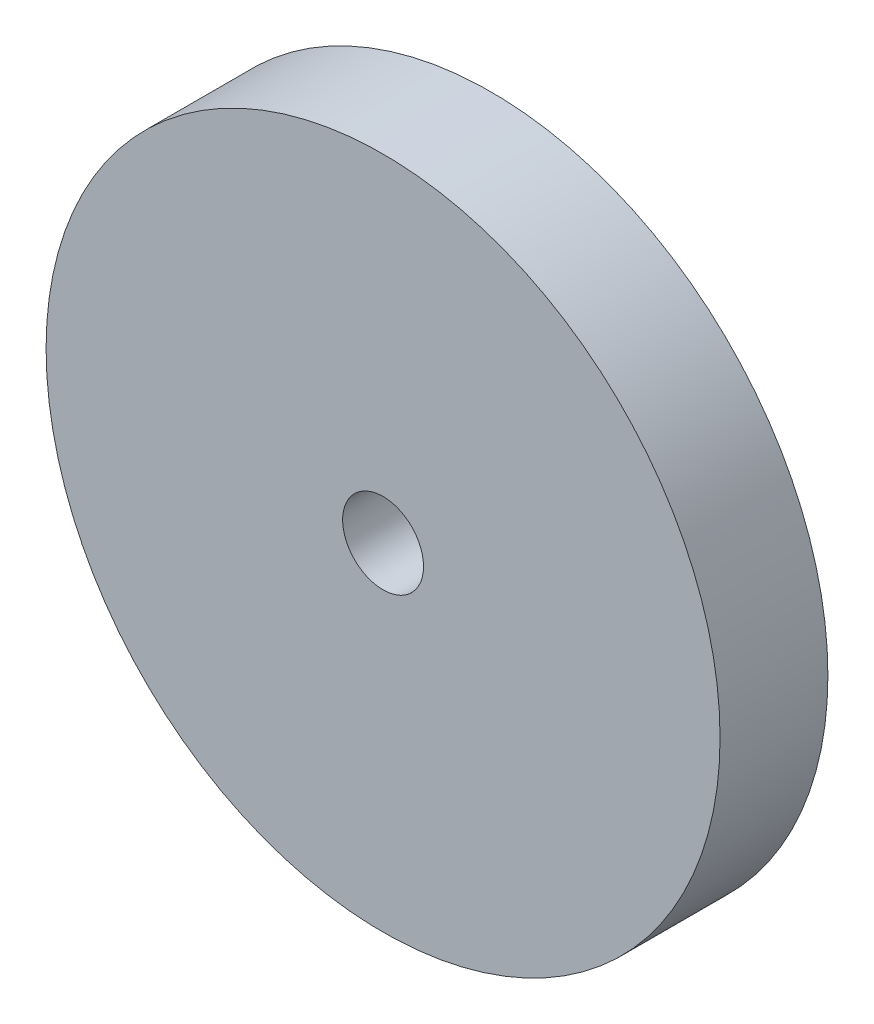
ISO-10303-21;
HEADER;
FILE_DESCRIPTION(('STEP AP214'),'2;1');
FILE_NAME('part.step','',(''),(''),'','','');
FILE_SCHEMA(('AUTOMOTIVE_DESIGN { 1 0 10303 214 1 1 1 1 }'));
ENDSEC;
DATA;
#1=APPLICATION_CONTEXT('core data for automotive mechanical design processes');
#2=APPLICATION_PROTOCOL_DEFINITION('international standard','automotive_design',2000,#1);
#3=PRODUCT_CONTEXT('',#1,'mechanical');
#4=PRODUCT('Part','Part','',(#3));
#5=PRODUCT_RELATED_PRODUCT_CATEGORY('part','',(#4));
#6=PRODUCT_DEFINITION_FORMATION('','',#4);
#7=PRODUCT_DEFINITION_CONTEXT('part definition',#1,'design');
#8=PRODUCT_DEFINITION('design','',#6,#7);
#9=PRODUCT_DEFINITION_SHAPE('','',#8);
#10=(LENGTH_UNIT() NAMED_UNIT(*) SI_UNIT(.MILLI.,.METRE.));
#11=(NAMED_UNIT(*) PLANE_ANGLE_UNIT() SI_UNIT($,.RADIAN.));
#12=(NAMED_UNIT(*) SI_UNIT($,.STERADIAN.) SOLID_ANGLE_UNIT());
#13=UNCERTAINTY_MEASURE_WITH_UNIT(LENGTH_MEASURE(1.E-05),#10,'distance_accuracy_value','');
#14=(GEOMETRIC_REPRESENTATION_CONTEXT(3) GLOBAL_UNCERTAINTY_ASSIGNED_CONTEXT((#13)) GLOBAL_UNIT_ASSIGNED_CONTEXT((#10,
#11,#12)) REPRESENTATION_CONTEXT('',''));
#15=CARTESIAN_POINT('',(0.,0.,0.));
#16=DIRECTION('',(0.,0.,1.));
#17=DIRECTION('',(1.,0.,0.));
#18=AXIS2_PLACEMENT_3D('',#15,#16,#17);
#19=CARTESIAN_POINT('',(0.,0.,4.));
#20=DIRECTION('',(0.,0.,1.));
#21=DIRECTION('',(1.,0.,0.));
#22=AXIS2_PLACEMENT_3D('',#19,#20,#21);
#23=PLANE('',#22);
#24=CARTESIAN_POINT('',(0.,0.,4.));
#25=DIRECTION('',(0.,0.,1.));
#26=DIRECTION('',(1.,0.,0.));
#27=AXIS2_PLACEMENT_3D('',#24,#25,#26);
#28=CIRCLE('',#27,12.5);
#29=CARTESIAN_POINT('',(12.5,0.,4.));
#30=VERTEX_POINT('',#29);
#31=EDGE_CURVE('E10',#30,#30,#28,.T.);
#32=ORIENTED_EDGE('',*,*,#31,.T.);
#33=EDGE_LOOP('',(#32));
#34=FACE_BOUND('',#33,.T.);
#35=CARTESIAN_POINT('',(0.,0.,4.));
#36=DIRECTION('',(0.,0.,1.));
#37=DIRECTION('',(1.,0.,0.));
#38=AXIS2_PLACEMENT_3D('',#35,#36,#37);
#39=CIRCLE('',#38,1.5);
#40=CARTESIAN_POINT('',(1.5,0.,4.));
#41=VERTEX_POINT('',#40);
#42=EDGE_CURVE('E50',#41,#41,#39,.T.);
#43=ORIENTED_EDGE('',*,*,#42,.F.);
#44=EDGE_LOOP('',(#43));
#45=FACE_BOUND('',#44,.T.);
#46=ADVANCED_FACE('F37',(#34,#45),#23,.T.);
#47=CARTESIAN_POINT('',(0.,0.,0.));
#48=DIRECTION('',(0.,0.,1.));
#49=DIRECTION('',(1.,0.,0.));
#50=AXIS2_PLACEMENT_3D('',#47,#48,#49);
#51=PLANE('',#50);
#52=CARTESIAN_POINT('',(0.,0.,0.));
#53=DIRECTION('',(0.,0.,1.));
#54=DIRECTION('',(1.,0.,0.));
#55=AXIS2_PLACEMENT_3D('',#52,#53,#54);
#56=CIRCLE('',#55,12.5);
#57=CARTESIAN_POINT('',(12.5,0.,0.));
#58=VERTEX_POINT('',#57);
#59=EDGE_CURVE('E41',#58,#58,#56,.T.);
#60=ORIENTED_EDGE('',*,*,#59,.F.);
#61=EDGE_LOOP('',(#60));
#62=FACE_BOUND('',#61,.T.);
#63=CARTESIAN_POINT('',(0.,0.,0.));
#64=DIRECTION('',(0.,0.,1.));
#65=DIRECTION('',(1.,0.,0.));
#66=AXIS2_PLACEMENT_3D('',#63,#64,#65);
#67=CIRCLE('',#66,1.5);
#68=CARTESIAN_POINT('',(1.5,0.,0.));
#69=VERTEX_POINT('',#68);
#70=EDGE_CURVE('E52',#69,#69,#67,.T.);
#71=ORIENTED_EDGE('',*,*,#70,.T.);
#72=EDGE_LOOP('',(#71));
#73=FACE_BOUND('',#72,.T.);
#74=ADVANCED_FACE('F64',(#62,#73),#51,.F.);
#75=CARTESIAN_POINT('',(0.,0.,4.));
#76=DIRECTION('',(0.,0.,-1.));
#77=DIRECTION('',(-1.,0.,0.));
#78=AXIS2_PLACEMENT_3D('',#75,#76,#77);
#79=CYLINDRICAL_SURFACE('',#78,12.5);
#80=ORIENTED_EDGE('',*,*,#31,.F.);
#81=EDGE_LOOP('',(#80));
#82=FACE_BOUND('',#81,.T.);
#83=ORIENTED_EDGE('',*,*,#59,.T.);
#84=EDGE_LOOP('',(#83));
#85=FACE_BOUND('',#84,.T.);
#86=ADVANCED_FACE('F39',(#82,#85),#79,.T.);
#87=CARTESIAN_POINT('',(0.,0.,4.));
#88=DIRECTION('',(0.,0.,-1.));
#89=DIRECTION('',(-1.,0.,0.));
#90=AXIS2_PLACEMENT_3D('',#87,#88,#89);
#91=CYLINDRICAL_SURFACE('',#90,1.5);
#92=ORIENTED_EDGE('',*,*,#42,.T.);
#93=EDGE_LOOP('',(#92));
#94=FACE_BOUND('',#93,.T.);
#95=ORIENTED_EDGE('',*,*,#70,.F.);
#96=EDGE_LOOP('',(#95));
#97=FACE_BOUND('',#96,.T.);
#98=ADVANCED_FACE('F60',(#94,#97),#91,.F.);
#99=CLOSED_SHELL('',(#46,#74,#86,#98));
#100=MANIFOLD_SOLID_BREP('B2',#99);
#101=ADVANCED_BREP_SHAPE_REPRESENTATION('',(#18,#100),#14);
#102=SHAPE_DEFINITION_REPRESENTATION(#9,#101);
ENDSEC;
END-ISO-10303-21;
